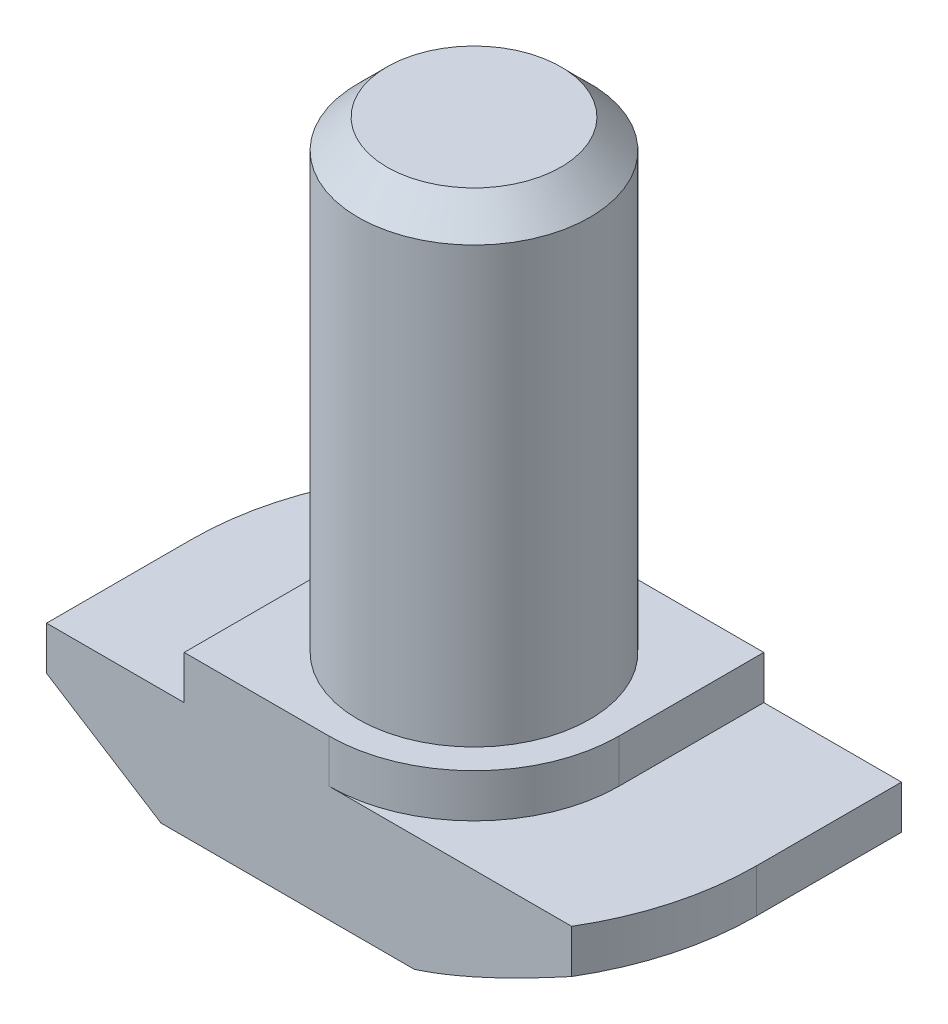
ISO-10303-21;
HEADER;
FILE_DESCRIPTION(('STEP AP214'),'2;1');
FILE_NAME('part.step','',(''),(''),'','','');
FILE_SCHEMA(('AUTOMOTIVE_DESIGN { 1 0 10303 214 1 1 1 1 }'));
ENDSEC;
DATA;
#1=APPLICATION_CONTEXT('core data for automotive mechanical design processes');
#2=APPLICATION_PROTOCOL_DEFINITION('international standard','automotive_design',2000,#1);
#3=PRODUCT_CONTEXT('',#1,'mechanical');
#4=PRODUCT('Part','Part','',(#3));
#5=PRODUCT_RELATED_PRODUCT_CATEGORY('part','',(#4));
#6=PRODUCT_DEFINITION_FORMATION('','',#4);
#7=PRODUCT_DEFINITION_CONTEXT('part definition',#1,'design');
#8=PRODUCT_DEFINITION('design','',#6,#7);
#9=PRODUCT_DEFINITION_SHAPE('','',#8);
#10=(LENGTH_UNIT() NAMED_UNIT(*) SI_UNIT(.MILLI.,.METRE.));
#11=(NAMED_UNIT(*) PLANE_ANGLE_UNIT() SI_UNIT($,.RADIAN.));
#12=(NAMED_UNIT(*) SI_UNIT($,.STERADIAN.) SOLID_ANGLE_UNIT());
#13=UNCERTAINTY_MEASURE_WITH_UNIT(LENGTH_MEASURE(1.E-05),#10,'distance_accuracy_value','');
#14=(GEOMETRIC_REPRESENTATION_CONTEXT(3) GLOBAL_UNCERTAINTY_ASSIGNED_CONTEXT((#13)) GLOBAL_UNIT_ASSIGNED_CONTEXT((#10,
#11,#12)) REPRESENTATION_CONTEXT('',''));
#15=CARTESIAN_POINT('',(0.,0.,0.));
#16=DIRECTION('',(0.,0.,1.));
#17=DIRECTION('',(1.,0.,0.));
#18=AXIS2_PLACEMENT_3D('',#15,#16,#17);
#19=CARTESIAN_POINT('',(-9.75,0.,5.));
#20=DIRECTION('',(1.,0.,0.));
#21=DIRECTION('',(0.,0.,-1.));
#22=AXIS2_PLACEMENT_3D('',#19,#20,#21);
#23=PLANE('',#22);
#24=DIRECTION('',(0.,0.,-1.));
#25=VECTOR('',#24,1.);
#26=CARTESIAN_POINT('',(-9.75,2.5,5.));
#27=LINE('',#26,#25);
#28=CARTESIAN_POINT('',(-9.75,2.5,5.));
#29=VERTEX_POINT('',#28);
#30=CARTESIAN_POINT('',(-9.75,2.5,0.));
#31=VERTEX_POINT('',#30);
#32=EDGE_CURVE('E372',#29,#31,#27,.T.);
#33=ORIENTED_EDGE('',*,*,#32,.F.);
#34=DIRECTION('',(0.,-1.,0.));
#35=VECTOR('',#34,1.);
#36=CARTESIAN_POINT('',(-9.75,0.,5.));
#37=LINE('',#36,#35);
#38=CARTESIAN_POINT('',(-9.75,4.,5.));
#39=VERTEX_POINT('',#38);
#40=EDGE_CURVE('E209',#39,#29,#37,.T.);
#41=ORIENTED_EDGE('',*,*,#40,.F.);
#42=DIRECTION('',(0.,0.,-1.));
#43=VECTOR('',#42,1.);
#44=CARTESIAN_POINT('',(-9.75,4.,5.));
#45=LINE('',#44,#43);
#46=CARTESIAN_POINT('',(-9.75,4.,0.));
#47=VERTEX_POINT('',#46);
#48=EDGE_CURVE('E224',#39,#47,#45,.T.);
#49=ORIENTED_EDGE('',*,*,#48,.T.);
#50=DIRECTION('',(0.,1.,0.));
#51=VECTOR('',#50,1.);
#52=CARTESIAN_POINT('',(-9.75,0.,0.));
#53=LINE('',#52,#51);
#54=EDGE_CURVE('E190',#31,#47,#53,.T.);
#55=ORIENTED_EDGE('',*,*,#54,.F.);
#56=EDGE_LOOP('',(#33,#41,#49,#55));
#57=FACE_BOUND('',#56,.T.);
#58=ADVANCED_FACE('F37',(#57),#23,.F.);
#59=CARTESIAN_POINT('',(9.75,0.,5.));
#60=DIRECTION('',(0.,1.,0.));
#61=DIRECTION('',(0.,0.,1.));
#62=AXIS2_PLACEMENT_3D('',#59,#60,#61);
#63=PLANE('',#62);
#64=DIRECTION('',(1.,0.,0.));
#65=VECTOR('',#64,1.);
#66=CARTESIAN_POINT('',(9.75,0.,5.));
#67=LINE('',#66,#65);
#68=CARTESIAN_POINT('',(-5.8,0.,5.));
#69=VERTEX_POINT('',#68);
#70=CARTESIAN_POINT('',(2.93938769133981,0.,5.));
#71=VERTEX_POINT('',#70);
#72=EDGE_CURVE('E212',#69,#71,#67,.T.);
#73=ORIENTED_EDGE('',*,*,#72,.F.);
#74=DIRECTION('',(0.,0.,-1.));
#75=VECTOR('',#74,1.);
#76=CARTESIAN_POINT('',(-5.8,0.,5.));
#77=LINE('',#76,#75);
#78=CARTESIAN_POINT('',(-5.8,0.,0.));
#79=VERTEX_POINT('',#78);
#80=EDGE_CURVE('E375',#69,#79,#77,.T.);
#81=ORIENTED_EDGE('',*,*,#80,.T.);
#82=CARTESIAN_POINT('',(0.,0.,0.));
#83=DIRECTION('',(0.,-1.,0.));
#84=DIRECTION('',(-1.,0.,0.));
#85=AXIS2_PLACEMENT_3D('',#82,#83,#84);
#86=CIRCLE('',#85,5.8);
#87=CARTESIAN_POINT('',(-2.93938769133982,0.,-5.));
#88=VERTEX_POINT('',#87);
#89=EDGE_CURVE('E385',#79,#88,#86,.T.);
#90=ORIENTED_EDGE('',*,*,#89,.T.);
#91=DIRECTION('',(1.,0.,0.));
#92=VECTOR('',#91,1.);
#93=CARTESIAN_POINT('',(9.75,0.,-5.));
#94=LINE('',#93,#92);
#95=CARTESIAN_POINT('',(5.8,0.,-5.));
#96=VERTEX_POINT('',#95);
#97=EDGE_CURVE('E208',#88,#96,#94,.T.);
#98=ORIENTED_EDGE('',*,*,#97,.T.);
#99=DIRECTION('',(0.,0.,1.));
#100=VECTOR('',#99,1.);
#101=CARTESIAN_POINT('',(5.8,0.,-9.75));
#102=LINE('',#101,#100);
#103=CARTESIAN_POINT('',(5.8,0.,0.));
#104=VERTEX_POINT('',#103);
#105=EDGE_CURVE('E53',#96,#104,#102,.T.);
#106=ORIENTED_EDGE('',*,*,#105,.T.);
#107=CARTESIAN_POINT('',(0.,0.,0.));
#108=DIRECTION('',(0.,-1.,0.));
#109=DIRECTION('',(1.,0.,0.));
#110=AXIS2_PLACEMENT_3D('',#107,#108,#109);
#111=CIRCLE('',#110,5.8);
#112=EDGE_CURVE('E153',#104,#71,#111,.T.);
#113=ORIENTED_EDGE('',*,*,#112,.T.);
#114=EDGE_LOOP('',(#73,#81,#90,#98,#106,#113));
#115=FACE_BOUND('',#114,.T.);
#116=ADVANCED_FACE('F270',(#115),#63,.F.);
#117=CARTESIAN_POINT('',(9.75,0.,5.));
#118=DIRECTION('',(-1.,0.,0.));
#119=DIRECTION('',(0.,0.,1.));
#120=AXIS2_PLACEMENT_3D('',#117,#118,#119);
#121=PLANE('',#120);
#122=DIRECTION('',(0.,0.,1.));
#123=VECTOR('',#122,1.);
#124=CARTESIAN_POINT('',(9.75,2.5,-9.75));
#125=LINE('',#124,#123);
#126=CARTESIAN_POINT('',(9.75,2.5,-5.));
#127=VERTEX_POINT('',#126);
#128=CARTESIAN_POINT('',(9.75,2.5,0.));
#129=VERTEX_POINT('',#128);
#130=EDGE_CURVE('E145',#127,#129,#125,.T.);
#131=ORIENTED_EDGE('',*,*,#130,.F.);
#132=DIRECTION('',(0.,1.,0.));
#133=VECTOR('',#132,1.);
#134=CARTESIAN_POINT('',(9.75,0.,-5.));
#135=LINE('',#134,#133);
#136=CARTESIAN_POINT('',(9.75,4.,-5.));
#137=VERTEX_POINT('',#136);
#138=EDGE_CURVE('E227',#127,#137,#135,.T.);
#139=ORIENTED_EDGE('',*,*,#138,.T.);
#140=DIRECTION('',(0.,0.,-1.));
#141=VECTOR('',#140,1.);
#142=CARTESIAN_POINT('',(9.75,4.,5.));
#143=LINE('',#142,#141);
#144=CARTESIAN_POINT('',(9.75,4.,0.));
#145=VERTEX_POINT('',#144);
#146=EDGE_CURVE('E173',#145,#137,#143,.T.);
#147=ORIENTED_EDGE('',*,*,#146,.F.);
#148=DIRECTION('',(0.,1.,0.));
#149=VECTOR('',#148,1.);
#150=CARTESIAN_POINT('',(9.75,0.,0.));
#151=LINE('',#150,#149);
#152=EDGE_CURVE('E166',#129,#145,#151,.T.);
#153=ORIENTED_EDGE('',*,*,#152,.F.);
#154=EDGE_LOOP('',(#131,#139,#147,#153));
#155=FACE_BOUND('',#154,.T.);
#156=ADVANCED_FACE('F171',(#155),#121,.F.);
#157=CARTESIAN_POINT('',(0.,0.,5.));
#158=DIRECTION('',(0.,0.,-1.));
#159=DIRECTION('',(-1.,0.,0.));
#160=AXIS2_PLACEMENT_3D('',#157,#158,#159);
#161=PLANE('',#160);
#162=DIRECTION('',(-0.844980197489509,0.534797593347791,0.));
#163=VECTOR('',#162,1.);
#164=CARTESIAN_POINT('',(-9.75,2.5,5.));
#165=LINE('',#164,#163);
#166=EDGE_CURVE('E373',#69,#29,#165,.T.);
#167=ORIENTED_EDGE('',*,*,#166,.F.);
#168=ORIENTED_EDGE('',*,*,#72,.T.);
#169=CARTESIAN_POINT('',(8.3710345213916,2.50038035044416,5.));
#170=CARTESIAN_POINT('',(8.14485503763147,2.37751255056509,5.));
#171=CARTESIAN_POINT('',(7.91814414436424,2.25560825185528,5.));
#172=CARTESIAN_POINT('',(7.46336802856226,2.01427419874183,5.));
#173=CARTESIAN_POINT('',(7.23530261352057,1.89484480745523,5.));
#174=CARTESIAN_POINT('',(6.77658273225198,1.65852444966252,5.));
#175=CARTESIAN_POINT('',(6.54592128446781,1.54164699581211,5.));
#176=CARTESIAN_POINT('',(6.08267383878011,1.31178770374963,5.));
#177=CARTESIAN_POINT('',(5.85008793878494,1.19880566884712,5.));
#178=CARTESIAN_POINT('',(5.38850045895099,0.980602867779513,5.));
#179=CARTESIAN_POINT('',(5.1595578408824,0.875257869563463,5.));
#180=CARTESIAN_POINT('',(4.69895239023341,0.670592548807996,5.));
#181=CARTESIAN_POINT('',(4.46728928872485,0.571272827972461,5.));
#182=CARTESIAN_POINT('',(4.00108707979834,0.38059166900738,5.));
#183=CARTESIAN_POINT('',(3.76655273287754,0.289218677543095,5.));
#184=CARTESIAN_POINT('',(3.29379614776259,0.116644148005836,5.));
#185=CARTESIAN_POINT('',(3.05557490729072,0.0354399103972046,5.));
#186=CARTESIAN_POINT('',(2.58854667138869,-0.109582099168053,5.));
#187=CARTESIAN_POINT('',(2.35996631966938,-0.174122082532671,5.));
#188=CARTESIAN_POINT('',(1.89919260818542,-0.288382603381046,5.));
#189=CARTESIAN_POINT('',(1.66700173473846,-0.33811290172539,5.));
#190=CARTESIAN_POINT('',(1.31509928874305,-0.399489564391158,5.));
#191=CARTESIAN_POINT('',(1.19653459621012,-0.417808799856712,5.));
#192=CARTESIAN_POINT('',(0.958746309721246,-0.449516897628666,5.));
#193=CARTESIAN_POINT('',(0.839522754036867,-0.462906043317658,5.));
#194=CARTESIAN_POINT('',(0.600273143638718,-0.484487035929079,5.));
#195=CARTESIAN_POINT('',(0.480245784105953,-0.492664504258673,5.));
#196=CARTESIAN_POINT('',(0.239914647066935,-0.50360257514633,5.));
#197=CARTESIAN_POINT('',(0.119610806307569,-0.506361781459069,5.));
#198=CARTESIAN_POINT('',(-0.000700000000000271,-0.506329082911393,5.));
#199=B_SPLINE_CURVE_WITH_KNOTS('',3,(#169,#170,#171,#172,#173,#174,#175,#176,#177,#178,#179,
#180,#181,#182,#183,#184,#185,#186,#187,#188,#189,#190,#191,#192,#193,#194,#195,#196,#197,#198),
.UNSPECIFIED.,.F.,.F.,(4,2,2,2,2,2,2,2,2,2,2,2,2,2,4),(0.,0.772201750738158,1.54451600760777,
2.32023520866627,3.09591518399236,3.85189775311528,4.60795569327251,5.36289539506572,
6.1176342534965,6.82981297940338,7.54152127390794,7.90134934767844,8.26115673522602,
8.62195255315834,8.98284133326183),.UNSPECIFIED.);
#200=CARTESIAN_POINT('',(8.3703345213916,2.5,5.));
#201=VERTEX_POINT('',#200);
#202=EDGE_CURVE('E318',#201,#71,#199,.T.);
#203=ORIENTED_EDGE('',*,*,#202,.F.);
#204=DIRECTION('',(0.,1.,0.));
#205=VECTOR('',#204,1.);
#206=CARTESIAN_POINT('',(8.3703345213916,0.,5.));
#207=LINE('',#206,#205);
#208=CARTESIAN_POINT('',(8.3703345213916,4.,5.));
#209=VERTEX_POINT('',#208);
#210=EDGE_CURVE('E168',#201,#209,#207,.T.);
#211=ORIENTED_EDGE('',*,*,#210,.T.);
#212=DIRECTION('',(-1.,0.,0.));
#213=VECTOR('',#212,1.);
#214=CARTESIAN_POINT('',(9.75,4.,5.));
#215=LINE('',#214,#213);
#216=CARTESIAN_POINT('',(0.,4.,5.));
#217=VERTEX_POINT('',#216);
#218=EDGE_CURVE('E216',#209,#217,#215,.T.);
#219=ORIENTED_EDGE('',*,*,#218,.T.);
#220=DIRECTION('',(0.,1.,0.));
#221=VECTOR('',#220,1.);
#222=CARTESIAN_POINT('',(0.,-3.07106781186548,5.));
#223=LINE('',#222,#221);
#224=CARTESIAN_POINT('',(0.,5.5,5.));
#225=VERTEX_POINT('',#224);
#226=EDGE_CURVE('E194',#217,#225,#223,.T.);
#227=ORIENTED_EDGE('',*,*,#226,.T.);
#228=DIRECTION('',(-1.,0.,0.));
#229=VECTOR('',#228,1.);
#230=CARTESIAN_POINT('',(-5.,5.5,5.));
#231=LINE('',#230,#229);
#232=CARTESIAN_POINT('',(-5.,5.5,5.));
#233=VERTEX_POINT('',#232);
#234=EDGE_CURVE('E218',#225,#233,#231,.T.);
#235=ORIENTED_EDGE('',*,*,#234,.T.);
#236=DIRECTION('',(0.,-1.,0.));
#237=VECTOR('',#236,1.);
#238=CARTESIAN_POINT('',(-5.,4.,5.));
#239=LINE('',#238,#237);
#240=CARTESIAN_POINT('',(-5.,4.,5.));
#241=VERTEX_POINT('',#240);
#242=EDGE_CURVE('E220',#233,#241,#239,.T.);
#243=ORIENTED_EDGE('',*,*,#242,.T.);
#244=DIRECTION('',(-1.,0.,0.));
#245=VECTOR('',#244,1.);
#246=CARTESIAN_POINT('',(-9.75,4.,5.));
#247=LINE('',#246,#245);
#248=EDGE_CURVE('E222',#241,#39,#247,.T.);
#249=ORIENTED_EDGE('',*,*,#248,.T.);
#250=ORIENTED_EDGE('',*,*,#40,.T.);
#251=EDGE_LOOP('',(#167,#168,#203,#211,#219,#227,#235,#243,#249,#250));
#252=FACE_BOUND('',#251,.T.);
#253=ADVANCED_FACE('F281',(#252),#161,.F.);
#254=CARTESIAN_POINT('',(0.,0.,-5.));
#255=DIRECTION('',(0.,0.,-1.));
#256=DIRECTION('',(-1.,0.,0.));
#257=AXIS2_PLACEMENT_3D('',#254,#255,#256);
#258=PLANE('',#257);
#259=ORIENTED_EDGE('',*,*,#97,.F.);
#260=CARTESIAN_POINT('',(0.00070000000000138,-0.506329082911397,-5.));
#261=CARTESIAN_POINT('',(-0.11492355286762,-0.506358201187866,-5.));
#262=CARTESIAN_POINT('',(-0.230541342283267,-0.503811651701555,-5.));
#263=CARTESIAN_POINT('',(-0.461532910337905,-0.493707507103407,-5.));
#264=CARTESIAN_POINT('',(-0.576906737550149,-0.48615102719651,-5.));
#265=CARTESIAN_POINT('',(-0.806948113963408,-0.466191618236643,-5.));
#266=CARTESIAN_POINT('',(-0.921616700128454,-0.453800577810883,-5.));
#267=CARTESIAN_POINT('',(-1.15036260798101,-0.424427750820964,-5.));
#268=CARTESIAN_POINT('',(-1.26443990025042,-0.407445738038838,-5.));
#269=CARTESIAN_POINT('',(-1.60314096911344,-0.350479262852961,-5.));
#270=CARTESIAN_POINT('',(-1.82673025128966,-0.304244681434307,-5.));
#271=CARTESIAN_POINT('',(-2.27058382288403,-0.197749704270996,-5.));
#272=CARTESIAN_POINT('',(-2.49084621805169,-0.13748161665558,-5.));
#273=CARTESIAN_POINT('',(-2.95448552535975,0.00231900980771354,-5.));
#274=CARTESIAN_POINT('',(-3.19742086780124,0.0833022458753652,-5.));
#275=CARTESIAN_POINT('',(-3.67941522891594,0.256156738222036,-5.));
#276=CARTESIAN_POINT('',(-3.91847303773159,0.348031321223873,-5.));
#277=CARTESIAN_POINT('',(-4.39361886594961,0.540256398970149,-5.));
#278=CARTESIAN_POINT('',(-4.62970092868475,0.640621503905241,-5.));
#279=CARTESIAN_POINT('',(-5.09899519125866,0.847741673465407,-5.));
#280=CARTESIAN_POINT('',(-5.33220771380245,0.95449601149878,-5.));
#281=CARTESIAN_POINT('',(-5.80260552399803,1.17594489337857,-5.));
#282=CARTESIAN_POINT('',(-6.0397260114898,1.29077650765228,-5.));
#283=CARTESIAN_POINT('',(-6.51194869465368,1.52453629386533,-5.));
#284=CARTESIAN_POINT('',(-6.74705077660686,1.6434646947539,-5.));
#285=CARTESIAN_POINT('',(-7.21442387447975,1.88395034865552,-5.));
#286=CARTESIAN_POINT('',(-7.44670315486301,2.00549158860828,-5.));
#287=CARTESIAN_POINT('',(-7.90984974140112,2.25114994882745,-5.));
#288=CARTESIAN_POINT('',(-8.14071726576929,2.37526665727356,-5.));
#289=CARTESIAN_POINT('',(-8.3710345213916,2.50038035044416,-5.));
#290=B_SPLINE_CURVE_WITH_KNOTS('',3,(#260,#261,#262,#263,#264,#265,#266,#267,#268,#269,#270,
#271,#272,#273,#274,#275,#276,#277,#278,#279,#280,#281,#282,#283,#284,#285,#286,#287,#288,#289),
.UNSPECIFIED.,.F.,.F.,(4,2,2,2,2,2,2,2,2,2,2,2,2,2,4),(0.,0.346832601073218,0.693588023504655,
1.03949606304986,1.38542115015583,2.06977108877902,2.75449701140492,3.52238142993095,
4.29050100328089,5.05997031676438,5.82935229087948,6.61968962937037,7.41007120780528,
8.19652251048066,8.98284901326047),.UNSPECIFIED.);
#291=CARTESIAN_POINT('',(-8.3703345213916,2.5,-5.));
#292=VERTEX_POINT('',#291);
#293=EDGE_CURVE('E312',#88,#292,#290,.T.);
#294=ORIENTED_EDGE('',*,*,#293,.T.);
#295=DIRECTION('',(0.,1.,0.));
#296=VECTOR('',#295,1.);
#297=CARTESIAN_POINT('',(-8.3703345213916,0.,-5.));
#298=LINE('',#297,#296);
#299=CARTESIAN_POINT('',(-8.3703345213916,4.,-5.));
#300=VERTEX_POINT('',#299);
#301=EDGE_CURVE('E177',#292,#300,#298,.T.);
#302=ORIENTED_EDGE('',*,*,#301,.T.);
#303=DIRECTION('',(-1.,0.,0.));
#304=VECTOR('',#303,1.);
#305=CARTESIAN_POINT('',(-9.75,4.,-5.));
#306=LINE('',#305,#304);
#307=CARTESIAN_POINT('',(0.,4.,-5.));
#308=VERTEX_POINT('',#307);
#309=EDGE_CURVE('E213',#308,#300,#306,.T.);
#310=ORIENTED_EDGE('',*,*,#309,.F.);
#311=DIRECTION('',(0.,1.,0.));
#312=VECTOR('',#311,1.);
#313=CARTESIAN_POINT('',(0.,-3.07106781186548,-5.));
#314=LINE('',#313,#312);
#315=CARTESIAN_POINT('',(0.,5.5,-5.));
#316=VERTEX_POINT('',#315);
#317=EDGE_CURVE('E204',#308,#316,#314,.T.);
#318=ORIENTED_EDGE('',*,*,#317,.T.);
#319=DIRECTION('',(-1.,0.,0.));
#320=VECTOR('',#319,1.);
#321=CARTESIAN_POINT('',(-5.,5.5,-5.));
#322=LINE('',#321,#320);
#323=CARTESIAN_POINT('',(5.,5.5,-5.));
#324=VERTEX_POINT('',#323);
#325=EDGE_CURVE('E235',#324,#316,#322,.T.);
#326=ORIENTED_EDGE('',*,*,#325,.F.);
#327=DIRECTION('',(0.,1.,0.));
#328=VECTOR('',#327,1.);
#329=CARTESIAN_POINT('',(5.,4.,-5.));
#330=LINE('',#329,#328);
#331=CARTESIAN_POINT('',(5.,4.,-5.));
#332=VERTEX_POINT('',#331);
#333=EDGE_CURVE('E232',#332,#324,#330,.T.);
#334=ORIENTED_EDGE('',*,*,#333,.F.);
#335=DIRECTION('',(-1.,0.,0.));
#336=VECTOR('',#335,1.);
#337=CARTESIAN_POINT('',(9.75,4.,-5.));
#338=LINE('',#337,#336);
#339=EDGE_CURVE('E229',#137,#332,#338,.T.);
#340=ORIENTED_EDGE('',*,*,#339,.F.);
#341=ORIENTED_EDGE('',*,*,#138,.F.);
#342=DIRECTION('',(-0.84498019748951,-0.534797593347791,0.));
#343=VECTOR('',#342,1.);
#344=CARTESIAN_POINT('',(1.65884910193342,-2.6209815810548,-5.));
#345=LINE('',#344,#343);
#346=EDGE_CURVE('E149',#127,#96,#345,.T.);
#347=ORIENTED_EDGE('',*,*,#346,.T.);
#348=EDGE_LOOP('',(#259,#294,#302,#310,#318,#326,#334,#340,#341,#347));
#349=FACE_BOUND('',#348,.T.);
#350=ADVANCED_FACE('F303',(#349),#258,.T.);
#351=CARTESIAN_POINT('',(0.,0.,0.));
#352=DIRECTION('',(0.,1.,0.));
#353=DIRECTION('',(0.,0.,1.));
#354=AXIS2_PLACEMENT_3D('',#351,#352,#353);
#355=CYLINDRICAL_SURFACE('',#354,9.75);
#356=CARTESIAN_POINT('',(0.,2.5,0.));
#357=DIRECTION('',(0.,-1.,0.));
#358=DIRECTION('',(-1.,0.,0.));
#359=AXIS2_PLACEMENT_3D('',#356,#357,#358);
#360=CIRCLE('',#359,9.75);
#361=EDGE_CURVE('E61',#31,#292,#360,.T.);
#362=ORIENTED_EDGE('',*,*,#361,.F.);
#363=ORIENTED_EDGE('',*,*,#54,.T.);
#364=CARTESIAN_POINT('',(0.,4.,0.));
#365=DIRECTION('',(0.,-1.,0.));
#366=DIRECTION('',(0.,0.,-1.));
#367=AXIS2_PLACEMENT_3D('',#364,#365,#366);
#368=CIRCLE('',#367,9.75);
#369=EDGE_CURVE('E174',#47,#300,#368,.T.);
#370=ORIENTED_EDGE('',*,*,#369,.T.);
#371=ORIENTED_EDGE('',*,*,#301,.F.);
#372=EDGE_LOOP('',(#362,#363,#370,#371));
#373=FACE_BOUND('',#372,.T.);
#374=ADVANCED_FACE('F307',(#373),#355,.T.);
#375=CARTESIAN_POINT('',(0.,0.,0.));
#376=DIRECTION('',(0.,1.,0.));
#377=DIRECTION('',(0.,0.,1.));
#378=AXIS2_PLACEMENT_3D('',#375,#376,#377);
#379=CYLINDRICAL_SURFACE('',#378,9.75);
#380=CARTESIAN_POINT('',(0.,2.5,0.));
#381=DIRECTION('',(0.,-1.,0.));
#382=DIRECTION('',(1.,0.,0.));
#383=AXIS2_PLACEMENT_3D('',#380,#381,#382);
#384=CIRCLE('',#383,9.75);
#385=EDGE_CURVE('E158',#129,#201,#384,.T.);
#386=ORIENTED_EDGE('',*,*,#385,.F.);
#387=ORIENTED_EDGE('',*,*,#152,.T.);
#388=CARTESIAN_POINT('',(0.,4.,0.));
#389=DIRECTION('',(0.,-1.,0.));
#390=DIRECTION('',(0.,0.,-1.));
#391=AXIS2_PLACEMENT_3D('',#388,#389,#390);
#392=CIRCLE('',#391,9.75);
#393=EDGE_CURVE('E179',#145,#209,#392,.T.);
#394=ORIENTED_EDGE('',*,*,#393,.T.);
#395=ORIENTED_EDGE('',*,*,#210,.F.);
#396=EDGE_LOOP('',(#386,#387,#394,#395));
#397=FACE_BOUND('',#396,.T.);
#398=ADVANCED_FACE('F164',(#397),#379,.T.);
#399=CARTESIAN_POINT('',(-5.,5.5,5.));
#400=DIRECTION('',(0.,-1.,0.));
#401=DIRECTION('',(0.,0.,-1.));
#402=AXIS2_PLACEMENT_3D('',#399,#400,#401);
#403=PLANE('',#402);
#404=CARTESIAN_POINT('',(0.,5.5,0.));
#405=DIRECTION('',(0.,1.,0.));
#406=DIRECTION('',(0.,0.,1.));
#407=AXIS2_PLACEMENT_3D('',#404,#405,#406);
#408=CIRCLE('',#407,4.);
#409=CARTESIAN_POINT('',(0.,5.5,4.));
#410=VERTEX_POINT('',#409);
#411=EDGE_CURVE('E184',#410,#410,#408,.T.);
#412=ORIENTED_EDGE('',*,*,#411,.F.);
#413=EDGE_LOOP('',(#412));
#414=FACE_BOUND('',#413,.T.);
#415=ORIENTED_EDGE('',*,*,#234,.F.);
#416=CARTESIAN_POINT('',(0.,5.5,0.));
#417=DIRECTION('',(0.,-1.,0.));
#418=DIRECTION('',(0.,0.,-1.));
#419=AXIS2_PLACEMENT_3D('',#416,#417,#418);
#420=CIRCLE('',#419,5.);
#421=CARTESIAN_POINT('',(5.,5.5,0.));
#422=VERTEX_POINT('',#421);
#423=EDGE_CURVE('E187',#422,#225,#420,.T.);
#424=ORIENTED_EDGE('',*,*,#423,.F.);
#425=DIRECTION('',(0.,0.,-1.));
#426=VECTOR('',#425,1.);
#427=CARTESIAN_POINT('',(5.,5.5,5.));
#428=LINE('',#427,#426);
#429=EDGE_CURVE('E248',#422,#324,#428,.T.);
#430=ORIENTED_EDGE('',*,*,#429,.T.);
#431=ORIENTED_EDGE('',*,*,#325,.T.);
#432=CARTESIAN_POINT('',(0.,5.5,0.));
#433=DIRECTION('',(0.,-1.,0.));
#434=DIRECTION('',(0.,0.,-1.));
#435=AXIS2_PLACEMENT_3D('',#432,#433,#434);
#436=CIRCLE('',#435,5.);
#437=CARTESIAN_POINT('',(-5.,5.5,0.));
#438=VERTEX_POINT('',#437);
#439=EDGE_CURVE('E198',#438,#316,#436,.T.);
#440=ORIENTED_EDGE('',*,*,#439,.F.);
#441=DIRECTION('',(0.,0.,-1.));
#442=VECTOR('',#441,1.);
#443=CARTESIAN_POINT('',(-5.,5.5,5.));
#444=LINE('',#443,#442);
#445=EDGE_CURVE('E245',#233,#438,#444,.T.);
#446=ORIENTED_EDGE('',*,*,#445,.F.);
#447=EDGE_LOOP('',(#415,#424,#430,#431,#440,#446));
#448=FACE_BOUND('',#447,.T.);
#449=ADVANCED_FACE('F286',(#414,#448),#403,.F.);
#450=CARTESIAN_POINT('',(9.75,4.,5.));
#451=DIRECTION('',(0.,-1.,0.));
#452=DIRECTION('',(0.,0.,-1.));
#453=AXIS2_PLACEMENT_3D('',#450,#451,#452);
#454=PLANE('',#453);
#455=ORIENTED_EDGE('',*,*,#218,.F.);
#456=ORIENTED_EDGE('',*,*,#393,.F.);
#457=ORIENTED_EDGE('',*,*,#146,.T.);
#458=ORIENTED_EDGE('',*,*,#339,.T.);
#459=DIRECTION('',(0.,0.,-1.));
#460=VECTOR('',#459,1.);
#461=CARTESIAN_POINT('',(5.,4.,5.));
#462=LINE('',#461,#460);
#463=CARTESIAN_POINT('',(5.,4.,0.));
#464=VERTEX_POINT('',#463);
#465=EDGE_CURVE('E250',#464,#332,#462,.T.);
#466=ORIENTED_EDGE('',*,*,#465,.F.);
#467=CARTESIAN_POINT('',(0.,4.,0.));
#468=DIRECTION('',(0.,-1.,0.));
#469=DIRECTION('',(0.,0.,-1.));
#470=AXIS2_PLACEMENT_3D('',#467,#468,#469);
#471=CIRCLE('',#470,5.);
#472=EDGE_CURVE('E191',#464,#217,#471,.T.);
#473=ORIENTED_EDGE('',*,*,#472,.T.);
#474=EDGE_LOOP('',(#455,#456,#457,#458,#466,#473));
#475=FACE_BOUND('',#474,.T.);
#476=ADVANCED_FACE('F282',(#475),#454,.F.);
#477=CARTESIAN_POINT('',(5.,4.,5.));
#478=DIRECTION('',(-1.,0.,0.));
#479=DIRECTION('',(0.,0.,1.));
#480=AXIS2_PLACEMENT_3D('',#477,#478,#479);
#481=PLANE('',#480);
#482=ORIENTED_EDGE('',*,*,#429,.F.);
#483=DIRECTION('',(0.,1.,0.));
#484=VECTOR('',#483,1.);
#485=CARTESIAN_POINT('',(5.,-3.07106781186548,0.));
#486=LINE('',#485,#484);
#487=EDGE_CURVE('E189',#464,#422,#486,.T.);
#488=ORIENTED_EDGE('',*,*,#487,.F.);
#489=ORIENTED_EDGE('',*,*,#465,.T.);
#490=ORIENTED_EDGE('',*,*,#333,.T.);
#491=EDGE_LOOP('',(#482,#488,#489,#490));
#492=FACE_BOUND('',#491,.T.);
#493=ADVANCED_FACE('F285',(#492),#481,.F.);
#494=CARTESIAN_POINT('',(-5.,4.,5.));
#495=DIRECTION('',(1.,0.,0.));
#496=DIRECTION('',(0.,0.,-1.));
#497=AXIS2_PLACEMENT_3D('',#494,#495,#496);
#498=PLANE('',#497);
#499=ORIENTED_EDGE('',*,*,#445,.T.);
#500=DIRECTION('',(0.,1.,0.));
#501=VECTOR('',#500,1.);
#502=CARTESIAN_POINT('',(-5.,-3.07106781186548,0.));
#503=LINE('',#502,#501);
#504=CARTESIAN_POINT('',(-5.,4.,0.));
#505=VERTEX_POINT('',#504);
#506=EDGE_CURVE('E200',#505,#438,#503,.T.);
#507=ORIENTED_EDGE('',*,*,#506,.F.);
#508=DIRECTION('',(0.,0.,-1.));
#509=VECTOR('',#508,1.);
#510=CARTESIAN_POINT('',(-5.,4.,5.));
#511=LINE('',#510,#509);
#512=EDGE_CURVE('E242',#241,#505,#511,.T.);
#513=ORIENTED_EDGE('',*,*,#512,.F.);
#514=ORIENTED_EDGE('',*,*,#242,.F.);
#515=EDGE_LOOP('',(#499,#507,#513,#514));
#516=FACE_BOUND('',#515,.T.);
#517=ADVANCED_FACE('F290',(#516),#498,.F.);
#518=CARTESIAN_POINT('',(-9.75,4.,5.));
#519=DIRECTION('',(0.,-1.,0.));
#520=DIRECTION('',(0.,0.,-1.));
#521=AXIS2_PLACEMENT_3D('',#518,#519,#520);
#522=PLANE('',#521);
#523=ORIENTED_EDGE('',*,*,#309,.T.);
#524=ORIENTED_EDGE('',*,*,#369,.F.);
#525=ORIENTED_EDGE('',*,*,#48,.F.);
#526=ORIENTED_EDGE('',*,*,#248,.F.);
#527=ORIENTED_EDGE('',*,*,#512,.T.);
#528=CARTESIAN_POINT('',(0.,4.,0.));
#529=DIRECTION('',(0.,-1.,0.));
#530=DIRECTION('',(0.,0.,-1.));
#531=AXIS2_PLACEMENT_3D('',#528,#529,#530);
#532=CIRCLE('',#531,5.);
#533=EDGE_CURVE('E201',#505,#308,#532,.T.);
#534=ORIENTED_EDGE('',*,*,#533,.T.);
#535=EDGE_LOOP('',(#523,#524,#525,#526,#527,#534));
#536=FACE_BOUND('',#535,.T.);
#537=ADVANCED_FACE('F297',(#536),#522,.F.);
#538=CARTESIAN_POINT('',(0.,-3.07106781186548,0.));
#539=DIRECTION('',(0.,1.,0.));
#540=DIRECTION('',(0.,0.,1.));
#541=AXIS2_PLACEMENT_3D('',#538,#539,#540);
#542=CYLINDRICAL_SURFACE('',#541,5.);
#543=ORIENTED_EDGE('',*,*,#506,.T.);
#544=ORIENTED_EDGE('',*,*,#439,.T.);
#545=ORIENTED_EDGE('',*,*,#317,.F.);
#546=ORIENTED_EDGE('',*,*,#533,.F.);
#547=EDGE_LOOP('',(#543,#544,#545,#546));
#548=FACE_BOUND('',#547,.T.);
#549=ADVANCED_FACE('F301',(#548),#542,.T.);
#550=CARTESIAN_POINT('',(0.,-3.07106781186548,0.));
#551=DIRECTION('',(0.,1.,0.));
#552=DIRECTION('',(0.,0.,1.));
#553=AXIS2_PLACEMENT_3D('',#550,#551,#552);
#554=CYLINDRICAL_SURFACE('',#553,5.);
#555=ORIENTED_EDGE('',*,*,#487,.T.);
#556=ORIENTED_EDGE('',*,*,#423,.T.);
#557=ORIENTED_EDGE('',*,*,#226,.F.);
#558=ORIENTED_EDGE('',*,*,#472,.F.);
#559=EDGE_LOOP('',(#555,#556,#557,#558));
#560=FACE_BOUND('',#559,.T.);
#561=ADVANCED_FACE('F339',(#560),#554,.T.);
#562=CARTESIAN_POINT('',(0.,21.5,0.));
#563=DIRECTION('',(0.,-1.,0.));
#564=DIRECTION('',(0.,0.,-1.));
#565=AXIS2_PLACEMENT_3D('',#562,#563,#564);
#566=CYLINDRICAL_SURFACE('',#565,4.);
#567=CARTESIAN_POINT('',(0.,20.5,0.));
#568=DIRECTION('',(0.,1.,0.));
#569=DIRECTION('',(0.,0.,1.));
#570=AXIS2_PLACEMENT_3D('',#567,#568,#569);
#571=CIRCLE('',#570,4.);
#572=CARTESIAN_POINT('',(0.,20.5,4.));
#573=VERTEX_POINT('',#572);
#574=EDGE_CURVE('E11',#573,#573,#571,.F.);
#575=ORIENTED_EDGE('',*,*,#574,.T.);
#576=EDGE_LOOP('',(#575));
#577=FACE_BOUND('',#576,.T.);
#578=ORIENTED_EDGE('',*,*,#411,.T.);
#579=EDGE_LOOP('',(#578));
#580=FACE_BOUND('',#579,.T.);
#581=ADVANCED_FACE('F336',(#577,#580),#566,.T.);
#582=CARTESIAN_POINT('',(0.,21.5,0.));
#583=DIRECTION('',(0.,1.,0.));
#584=DIRECTION('',(0.,0.,1.));
#585=AXIS2_PLACEMENT_3D('',#582,#583,#584);
#586=PLANE('',#585);
#587=CARTESIAN_POINT('',(0.,21.5,0.));
#588=DIRECTION('',(0.,1.,0.));
#589=DIRECTION('',(0.,0.,1.));
#590=AXIS2_PLACEMENT_3D('',#587,#588,#589);
#591=CIRCLE('',#590,3.);
#592=CARTESIAN_POINT('',(0.,21.5,3.));
#593=VERTEX_POINT('',#592);
#594=EDGE_CURVE('E46',#593,#593,#591,.T.);
#595=ORIENTED_EDGE('',*,*,#594,.T.);
#596=EDGE_LOOP('',(#595));
#597=FACE_BOUND('',#596,.T.);
#598=ADVANCED_FACE('F255',(#597),#586,.T.);
#599=CARTESIAN_POINT('',(9.75,2.5,-9.75));
#600=DIRECTION('',(0.534797593347791,-0.84498019748951,0.));
#601=DIRECTION('',(0.84498019748951,0.534797593347791,0.));
#602=AXIS2_PLACEMENT_3D('',#599,#600,#601);
#603=PLANE('',#602);
#604=ORIENTED_EDGE('',*,*,#130,.T.);
#605=DIRECTION('',(0.844980197489509,0.534797593347791,0.));
#606=VECTOR('',#605,1.);
#607=CARTESIAN_POINT('',(9.75,2.5,0.));
#608=LINE('',#607,#606);
#609=EDGE_CURVE('E148',#104,#129,#608,.T.);
#610=ORIENTED_EDGE('',*,*,#609,.F.);
#611=ORIENTED_EDGE('',*,*,#105,.F.);
#612=ORIENTED_EDGE('',*,*,#346,.F.);
#613=EDGE_LOOP('',(#604,#610,#611,#612));
#614=FACE_BOUND('',#613,.T.);
#615=ADVANCED_FACE('F147',(#614),#603,.T.);
#616=CARTESIAN_POINT('',(0.,0.,0.));
#617=DIRECTION('',(0.,1.,0.));
#618=DIRECTION('',(0.,0.,1.));
#619=AXIS2_PLACEMENT_3D('',#616,#617,#618);
#620=CONICAL_SURFACE('',#619,5.8,1.00652813793696);
#621=ORIENTED_EDGE('',*,*,#202,.T.);
#622=ORIENTED_EDGE('',*,*,#112,.F.);
#623=ORIENTED_EDGE('',*,*,#609,.T.);
#624=ORIENTED_EDGE('',*,*,#385,.T.);
#625=EDGE_LOOP('',(#621,#622,#623,#624));
#626=FACE_BOUND('',#625,.T.);
#627=ADVANCED_FACE('F157',(#626),#620,.T.);
#628=CARTESIAN_POINT('',(-9.75,2.5,5.));
#629=DIRECTION('',(-0.534797593347791,-0.844980197489509,0.));
#630=DIRECTION('',(0.84498019748951,-0.534797593347791,0.));
#631=AXIS2_PLACEMENT_3D('',#628,#629,#630);
#632=PLANE('',#631);
#633=ORIENTED_EDGE('',*,*,#32,.T.);
#634=DIRECTION('',(-0.844980197489509,0.534797593347791,0.));
#635=VECTOR('',#634,1.);
#636=CARTESIAN_POINT('',(-9.75,2.5,0.));
#637=LINE('',#636,#635);
#638=EDGE_CURVE('E382',#79,#31,#637,.T.);
#639=ORIENTED_EDGE('',*,*,#638,.F.);
#640=ORIENTED_EDGE('',*,*,#80,.F.);
#641=ORIENTED_EDGE('',*,*,#166,.T.);
#642=EDGE_LOOP('',(#633,#639,#640,#641));
#643=FACE_BOUND('',#642,.T.);
#644=ADVANCED_FACE('F260',(#643),#632,.T.);
#645=CARTESIAN_POINT('',(0.,0.,0.));
#646=DIRECTION('',(0.,1.,0.));
#647=DIRECTION('',(0.,0.,1.));
#648=AXIS2_PLACEMENT_3D('',#645,#646,#647);
#649=CONICAL_SURFACE('',#648,5.8,1.00652813793696);
#650=ORIENTED_EDGE('',*,*,#89,.F.);
#651=ORIENTED_EDGE('',*,*,#638,.T.);
#652=ORIENTED_EDGE('',*,*,#361,.T.);
#653=ORIENTED_EDGE('',*,*,#293,.F.);
#654=EDGE_LOOP('',(#650,#651,#652,#653));
#655=FACE_BOUND('',#654,.T.);
#656=ADVANCED_FACE('F258',(#655),#649,.T.);
#657=CARTESIAN_POINT('',(0.,21.5,0.));
#658=DIRECTION('',(0.,-1.,0.));
#659=DIRECTION('',(0.,0.,-1.));
#660=AXIS2_PLACEMENT_3D('',#657,#658,#659);
#661=CONICAL_SURFACE('',#660,3.,0.785398163397447);
#662=ORIENTED_EDGE('',*,*,#574,.F.);
#663=EDGE_LOOP('',(#662));
#664=FACE_BOUND('',#663,.T.);
#665=ORIENTED_EDGE('',*,*,#594,.F.);
#666=EDGE_LOOP('',(#665));
#667=FACE_BOUND('',#666,.T.);
#668=ADVANCED_FACE('F40',(#664,#667),#661,.T.);
#669=CLOSED_SHELL('',(#58,#116,#156,#253,#350,#374,#398,#449,#476,#493,#517,#537,#549,#561,#581,
#598,#615,#627,#644,#656,#668));
#670=MANIFOLD_SOLID_BREP('B2',#669);
#671=ADVANCED_BREP_SHAPE_REPRESENTATION('',(#18,#670),#14);
#672=SHAPE_DEFINITION_REPRESENTATION(#9,#671);
ENDSEC;
END-ISO-10303-21;
